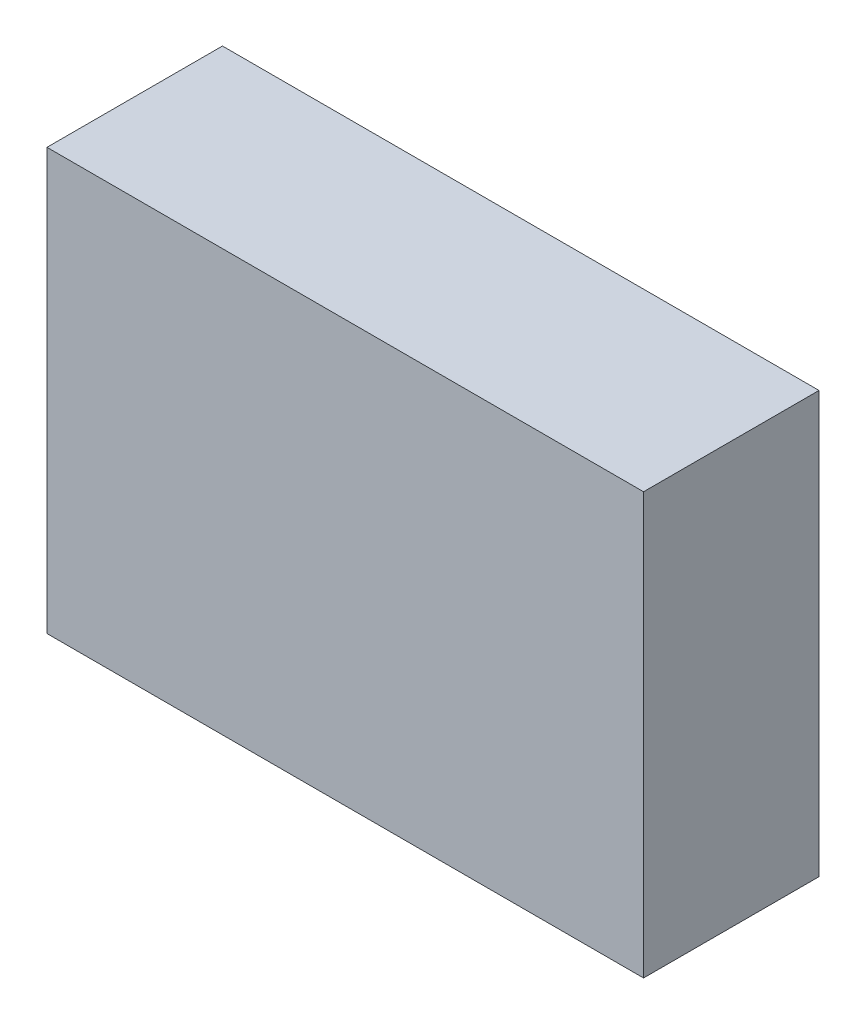
ISO-10303-21;
HEADER;
FILE_DESCRIPTION(('STEP AP214'),'2;1');
FILE_NAME('part.step','',(''),(''),'','','');
FILE_SCHEMA(('AUTOMOTIVE_DESIGN { 1 0 10303 214 1 1 1 1 }'));
ENDSEC;
DATA;
#1=APPLICATION_CONTEXT('core data for automotive mechanical design processes');
#2=APPLICATION_PROTOCOL_DEFINITION('international standard','automotive_design',2000,#1);
#3=PRODUCT_CONTEXT('',#1,'mechanical');
#4=PRODUCT('Part','Part','',(#3));
#5=PRODUCT_RELATED_PRODUCT_CATEGORY('part','',(#4));
#6=PRODUCT_DEFINITION_FORMATION('','',#4);
#7=PRODUCT_DEFINITION_CONTEXT('part definition',#1,'design');
#8=PRODUCT_DEFINITION('design','',#6,#7);
#9=PRODUCT_DEFINITION_SHAPE('','',#8);
#10=(LENGTH_UNIT() NAMED_UNIT(*) SI_UNIT(.MILLI.,.METRE.));
#11=(NAMED_UNIT(*) PLANE_ANGLE_UNIT() SI_UNIT($,.RADIAN.));
#12=(NAMED_UNIT(*) SI_UNIT($,.STERADIAN.) SOLID_ANGLE_UNIT());
#13=UNCERTAINTY_MEASURE_WITH_UNIT(LENGTH_MEASURE(1.E-05),#10,'distance_accuracy_value','');
#14=(GEOMETRIC_REPRESENTATION_CONTEXT(3) GLOBAL_UNCERTAINTY_ASSIGNED_CONTEXT((#13)) GLOBAL_UNIT_ASSIGNED_CONTEXT((#10,
#11,#12)) REPRESENTATION_CONTEXT('',''));
#15=CARTESIAN_POINT('',(0.,0.,0.));
#16=DIRECTION('',(0.,0.,1.));
#17=DIRECTION('',(1.,0.,0.));
#18=AXIS2_PLACEMENT_3D('',#15,#16,#17);
#19=CARTESIAN_POINT('',(2.58,0.13,0.));
#20=DIRECTION('',(1.,0.,0.));
#21=DIRECTION('',(0.,0.,1.));
#22=AXIS2_PLACEMENT_3D('',#19,#20,#21);
#23=PLANE('',#22);
#24=DIRECTION('',(0.,1.,0.));
#25=VECTOR('',#24,1.);
#26=CARTESIAN_POINT('',(2.58,0.13,0.1));
#27=LINE('',#26,#25);
#28=CARTESIAN_POINT('',(2.58,0.13,0.1));
#29=VERTEX_POINT('',#28);
#30=CARTESIAN_POINT('',(2.58,0.37,0.1));
#31=VERTEX_POINT('',#30);
#32=EDGE_CURVE('E11',#29,#31,#27,.T.);
#33=ORIENTED_EDGE('',*,*,#32,.T.);
#34=DIRECTION('',(0.,0.,1.));
#35=VECTOR('',#34,1.);
#36=CARTESIAN_POINT('',(2.58,0.37,0.));
#37=LINE('',#36,#35);
#38=CARTESIAN_POINT('',(2.58,0.37,0.));
#39=VERTEX_POINT('',#38);
#40=EDGE_CURVE('E24',#39,#31,#37,.T.);
#41=ORIENTED_EDGE('',*,*,#40,.F.);
#42=DIRECTION('',(0.,1.,0.));
#43=VECTOR('',#42,1.);
#44=CARTESIAN_POINT('',(2.58,0.13,0.));
#45=LINE('',#44,#43);
#46=CARTESIAN_POINT('',(2.58,0.13,0.));
#47=VERTEX_POINT('',#46);
#48=EDGE_CURVE('E86',#47,#39,#45,.T.);
#49=ORIENTED_EDGE('',*,*,#48,.F.);
#50=DIRECTION('',(0.,0.,1.));
#51=VECTOR('',#50,1.);
#52=CARTESIAN_POINT('',(2.58,0.13,0.));
#53=LINE('',#52,#51);
#54=EDGE_CURVE('E36',#47,#29,#53,.T.);
#55=ORIENTED_EDGE('',*,*,#54,.T.);
#56=EDGE_LOOP('',(#33,#41,#49,#55));
#57=FACE_BOUND('',#56,.T.);
#58=ADVANCED_FACE('F17',(#57),#23,.F.);
#59=CARTESIAN_POINT('',(2.92,0.13,0.));
#60=DIRECTION('',(1.,0.,0.));
#61=DIRECTION('',(0.,0.,1.));
#62=AXIS2_PLACEMENT_3D('',#59,#60,#61);
#63=PLANE('',#62);
#64=DIRECTION('',(0.,0.,1.));
#65=VECTOR('',#64,1.);
#66=CARTESIAN_POINT('',(2.92,0.13,0.));
#67=LINE('',#66,#65);
#68=CARTESIAN_POINT('',(2.92,0.13,0.));
#69=VERTEX_POINT('',#68);
#70=CARTESIAN_POINT('',(2.92,0.13,0.1));
#71=VERTEX_POINT('',#70);
#72=EDGE_CURVE('E83',#69,#71,#67,.T.);
#73=ORIENTED_EDGE('',*,*,#72,.F.);
#74=DIRECTION('',(0.,1.,0.));
#75=VECTOR('',#74,1.);
#76=CARTESIAN_POINT('',(2.92,0.13,0.));
#77=LINE('',#76,#75);
#78=CARTESIAN_POINT('',(2.92,0.37,0.));
#79=VERTEX_POINT('',#78);
#80=EDGE_CURVE('E63',#69,#79,#77,.T.);
#81=ORIENTED_EDGE('',*,*,#80,.T.);
#82=DIRECTION('',(0.,0.,1.));
#83=VECTOR('',#82,1.);
#84=CARTESIAN_POINT('',(2.92,0.37,0.));
#85=LINE('',#84,#83);
#86=CARTESIAN_POINT('',(2.92,0.37,0.1));
#87=VERTEX_POINT('',#86);
#88=EDGE_CURVE('E57',#79,#87,#85,.T.);
#89=ORIENTED_EDGE('',*,*,#88,.T.);
#90=DIRECTION('',(0.,1.,0.));
#91=VECTOR('',#90,1.);
#92=CARTESIAN_POINT('',(2.92,0.13,0.1));
#93=LINE('',#92,#91);
#94=EDGE_CURVE('E60',#71,#87,#93,.T.);
#95=ORIENTED_EDGE('',*,*,#94,.F.);
#96=EDGE_LOOP('',(#73,#81,#89,#95));
#97=FACE_BOUND('',#96,.T.);
#98=ADVANCED_FACE('F59',(#97),#63,.T.);
#99=CARTESIAN_POINT('',(2.58,0.13,0.));
#100=DIRECTION('',(0.,1.,0.));
#101=DIRECTION('',(0.,0.,1.));
#102=AXIS2_PLACEMENT_3D('',#99,#100,#101);
#103=PLANE('',#102);
#104=ORIENTED_EDGE('',*,*,#72,.T.);
#105=DIRECTION('',(1.,0.,0.));
#106=VECTOR('',#105,1.);
#107=CARTESIAN_POINT('',(2.58,0.13,0.1));
#108=LINE('',#107,#106);
#109=EDGE_CURVE('E71',#29,#71,#108,.T.);
#110=ORIENTED_EDGE('',*,*,#109,.F.);
#111=ORIENTED_EDGE('',*,*,#54,.F.);
#112=DIRECTION('',(1.,0.,0.));
#113=VECTOR('',#112,1.);
#114=CARTESIAN_POINT('',(2.58,0.13,0.));
#115=LINE('',#114,#113);
#116=EDGE_CURVE('E76',#47,#69,#115,.T.);
#117=ORIENTED_EDGE('',*,*,#116,.T.);
#118=EDGE_LOOP('',(#104,#110,#111,#117));
#119=FACE_BOUND('',#118,.T.);
#120=ADVANCED_FACE('F91',(#119),#103,.F.);
#121=CARTESIAN_POINT('',(2.58,0.37,0.));
#122=DIRECTION('',(0.,1.,0.));
#123=DIRECTION('',(0.,0.,1.));
#124=AXIS2_PLACEMENT_3D('',#121,#122,#123);
#125=PLANE('',#124);
#126=DIRECTION('',(1.,0.,0.));
#127=VECTOR('',#126,1.);
#128=CARTESIAN_POINT('',(2.58,0.37,0.));
#129=LINE('',#128,#127);
#130=EDGE_CURVE('E74',#39,#79,#129,.T.);
#131=ORIENTED_EDGE('',*,*,#130,.F.);
#132=ORIENTED_EDGE('',*,*,#40,.T.);
#133=DIRECTION('',(1.,0.,0.));
#134=VECTOR('',#133,1.);
#135=CARTESIAN_POINT('',(2.58,0.37,0.1));
#136=LINE('',#135,#134);
#137=EDGE_CURVE('E69',#31,#87,#136,.T.);
#138=ORIENTED_EDGE('',*,*,#137,.T.);
#139=ORIENTED_EDGE('',*,*,#88,.F.);
#140=EDGE_LOOP('',(#131,#132,#138,#139));
#141=FACE_BOUND('',#140,.T.);
#142=ADVANCED_FACE('F73',(#141),#125,.T.);
#143=CARTESIAN_POINT('',(2.58,0.13,0.));
#144=DIRECTION('',(0.,0.,1.));
#145=DIRECTION('',(1.,0.,0.));
#146=AXIS2_PLACEMENT_3D('',#143,#144,#145);
#147=PLANE('',#146);
#148=ORIENTED_EDGE('',*,*,#130,.T.);
#149=ORIENTED_EDGE('',*,*,#80,.F.);
#150=ORIENTED_EDGE('',*,*,#116,.F.);
#151=ORIENTED_EDGE('',*,*,#48,.T.);
#152=EDGE_LOOP('',(#148,#149,#150,#151));
#153=FACE_BOUND('',#152,.T.);
#154=ADVANCED_FACE('F89',(#153),#147,.F.);
#155=CARTESIAN_POINT('',(2.58,0.13,0.1));
#156=DIRECTION('',(0.,0.,1.));
#157=DIRECTION('',(1.,0.,0.));
#158=AXIS2_PLACEMENT_3D('',#155,#156,#157);
#159=PLANE('',#158);
#160=ORIENTED_EDGE('',*,*,#32,.F.);
#161=ORIENTED_EDGE('',*,*,#109,.T.);
#162=ORIENTED_EDGE('',*,*,#94,.T.);
#163=ORIENTED_EDGE('',*,*,#137,.F.);
#164=EDGE_LOOP('',(#160,#161,#162,#163));
#165=FACE_BOUND('',#164,.T.);
#166=ADVANCED_FACE('F68',(#165),#159,.T.);
#167=CLOSED_SHELL('',(#58,#98,#120,#142,#154,#166));
#168=MANIFOLD_SOLID_BREP('B1',#167);
#169=ADVANCED_BREP_SHAPE_REPRESENTATION('',(#18,#168),#14);
#170=SHAPE_DEFINITION_REPRESENTATION(#9,#169);
ENDSEC;
END-ISO-10303-21;
